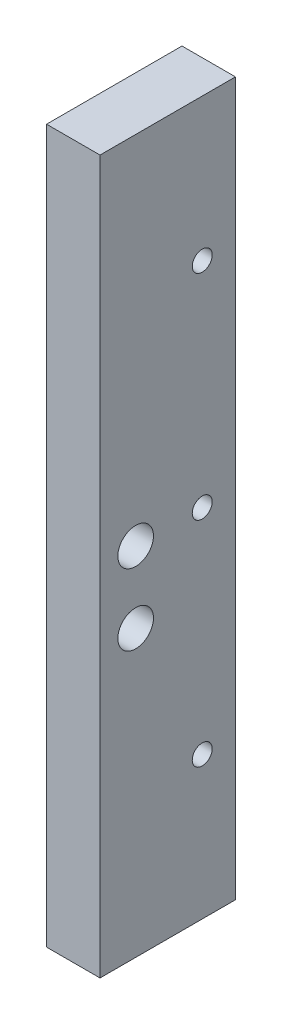
ISO-10303-21;
HEADER;
FILE_DESCRIPTION(('STEP AP214'),'2;1');
FILE_NAME('part.step','',(''),(''),'','','');
FILE_SCHEMA(('AUTOMOTIVE_DESIGN { 1 0 10303 214 1 1 1 1 }'));
ENDSEC;
DATA;
#1=APPLICATION_CONTEXT('core data for automotive mechanical design processes');
#2=APPLICATION_PROTOCOL_DEFINITION('international standard','automotive_design',2000,#1);
#3=PRODUCT_CONTEXT('',#1,'mechanical');
#4=PRODUCT('Part','Part','',(#3));
#5=PRODUCT_RELATED_PRODUCT_CATEGORY('part','',(#4));
#6=PRODUCT_DEFINITION_FORMATION('','',#4);
#7=PRODUCT_DEFINITION_CONTEXT('part definition',#1,'design');
#8=PRODUCT_DEFINITION('design','',#6,#7);
#9=PRODUCT_DEFINITION_SHAPE('','',#8);
#10=(LENGTH_UNIT() NAMED_UNIT(*) SI_UNIT(.MILLI.,.METRE.));
#11=(NAMED_UNIT(*) PLANE_ANGLE_UNIT() SI_UNIT($,.RADIAN.));
#12=(NAMED_UNIT(*) SI_UNIT($,.STERADIAN.) SOLID_ANGLE_UNIT());
#13=UNCERTAINTY_MEASURE_WITH_UNIT(LENGTH_MEASURE(1.E-05),#10,'distance_accuracy_value','');
#14=(GEOMETRIC_REPRESENTATION_CONTEXT(3) GLOBAL_UNCERTAINTY_ASSIGNED_CONTEXT((#13)) GLOBAL_UNIT_ASSIGNED_CONTEXT((#10,
#11,#12)) REPRESENTATION_CONTEXT('',''));
#15=CARTESIAN_POINT('',(0.,0.,0.));
#16=DIRECTION('',(0.,0.,1.));
#17=DIRECTION('',(1.,0.,0.));
#18=AXIS2_PLACEMENT_3D('',#15,#16,#17);
#19=CARTESIAN_POINT('',(0.,0.,24.13));
#20=DIRECTION('',(1.,0.,0.));
#21=DIRECTION('',(0.,0.,-1.));
#22=AXIS2_PLACEMENT_3D('',#19,#20,#21);
#23=PLANE('',#22);
#24=CARTESIAN_POINT('',(0.,50.8,17.78));
#25=DIRECTION('',(1.,0.,0.));
#26=DIRECTION('',(0.,0.,-1.));
#27=AXIS2_PLACEMENT_3D('',#24,#25,#26);
#28=CIRCLE('',#27,3.175);
#29=CARTESIAN_POINT('',(0.,50.8,14.605));
#30=VERTEX_POINT('',#29);
#31=EDGE_CURVE('E132',#30,#30,#28,.T.);
#32=ORIENTED_EDGE('',*,*,#31,.T.);
#33=EDGE_LOOP('',(#32));
#34=FACE_BOUND('',#33,.T.);
#35=CARTESIAN_POINT('',(0.,63.5,17.78));
#36=DIRECTION('',(1.,0.,0.));
#37=DIRECTION('',(0.,0.,-1.));
#38=AXIS2_PLACEMENT_3D('',#35,#36,#37);
#39=CIRCLE('',#38,3.175);
#40=CARTESIAN_POINT('',(0.,63.5,14.605));
#41=VERTEX_POINT('',#40);
#42=EDGE_CURVE('E124',#41,#41,#39,.T.);
#43=ORIENTED_EDGE('',*,*,#42,.T.);
#44=EDGE_LOOP('',(#43));
#45=FACE_BOUND('',#44,.T.);
#46=CARTESIAN_POINT('',(0.,25.4,5.91820000000001));
#47=DIRECTION('',(-1.,0.,0.));
#48=DIRECTION('',(0.,0.,1.));
#49=AXIS2_PLACEMENT_3D('',#46,#47,#48);
#50=CIRCLE('',#49,1.778);
#51=CARTESIAN_POINT('',(0.,25.4,7.69620000000001));
#52=VERTEX_POINT('',#51);
#53=EDGE_CURVE('E121',#52,#52,#50,.T.);
#54=ORIENTED_EDGE('',*,*,#53,.F.);
#55=EDGE_LOOP('',(#54));
#56=FACE_BOUND('',#55,.T.);
#57=CARTESIAN_POINT('',(0.,63.5,5.91820000000001));
#58=DIRECTION('',(-1.,0.,0.));
#59=DIRECTION('',(0.,0.,1.));
#60=AXIS2_PLACEMENT_3D('',#57,#58,#59);
#61=CIRCLE('',#60,1.778);
#62=CARTESIAN_POINT('',(0.,63.5,7.69620000000001));
#63=VERTEX_POINT('',#62);
#64=EDGE_CURVE('E115',#63,#63,#61,.T.);
#65=ORIENTED_EDGE('',*,*,#64,.F.);
#66=EDGE_LOOP('',(#65));
#67=FACE_BOUND('',#66,.T.);
#68=CARTESIAN_POINT('',(0.,101.6,5.9182));
#69=DIRECTION('',(-1.,0.,0.));
#70=DIRECTION('',(0.,0.,1.));
#71=AXIS2_PLACEMENT_3D('',#68,#69,#70);
#72=CIRCLE('',#71,1.778);
#73=CARTESIAN_POINT('',(0.,101.6,7.6962));
#74=VERTEX_POINT('',#73);
#75=EDGE_CURVE('E109',#74,#74,#72,.T.);
#76=ORIENTED_EDGE('',*,*,#75,.F.);
#77=EDGE_LOOP('',(#76));
#78=FACE_BOUND('',#77,.T.);
#79=DIRECTION('',(0.,-1.,0.));
#80=VECTOR('',#79,1.);
#81=CARTESIAN_POINT('',(0.,0.,0.));
#82=LINE('',#81,#80);
#83=CARTESIAN_POINT('',(0.,127.,0.));
#84=VERTEX_POINT('',#83);
#85=CARTESIAN_POINT('',(0.,0.,0.));
#86=VERTEX_POINT('',#85);
#87=EDGE_CURVE('E95',#84,#86,#82,.T.);
#88=ORIENTED_EDGE('',*,*,#87,.T.);
#89=DIRECTION('',(0.,0.,-1.));
#90=VECTOR('',#89,1.);
#91=CARTESIAN_POINT('',(0.,0.,24.13));
#92=LINE('',#91,#90);
#93=CARTESIAN_POINT('',(0.,0.,24.13));
#94=VERTEX_POINT('',#93);
#95=EDGE_CURVE('E11',#94,#86,#92,.T.);
#96=ORIENTED_EDGE('',*,*,#95,.F.);
#97=DIRECTION('',(0.,-1.,0.));
#98=VECTOR('',#97,1.);
#99=CARTESIAN_POINT('',(0.,0.,24.13));
#100=LINE('',#99,#98);
#101=CARTESIAN_POINT('',(0.,127.,24.13));
#102=VERTEX_POINT('',#101);
#103=EDGE_CURVE('E83',#102,#94,#100,.T.);
#104=ORIENTED_EDGE('',*,*,#103,.F.);
#105=DIRECTION('',(0.,0.,-1.));
#106=VECTOR('',#105,1.);
#107=CARTESIAN_POINT('',(0.,127.,24.13));
#108=LINE('',#107,#106);
#109=EDGE_CURVE('E91',#102,#84,#108,.T.);
#110=ORIENTED_EDGE('',*,*,#109,.T.);
#111=EDGE_LOOP('',(#88,#96,#104,#110));
#112=FACE_BOUND('',#111,.T.);
#113=ADVANCED_FACE('F32',(#34,#45,#56,#67,#78,#112),#23,.F.);
#114=CARTESIAN_POINT('',(0.,0.,24.13));
#115=DIRECTION('',(0.,1.,0.));
#116=DIRECTION('',(0.,0.,1.));
#117=AXIS2_PLACEMENT_3D('',#114,#115,#116);
#118=PLANE('',#117);
#119=DIRECTION('',(1.,0.,0.));
#120=VECTOR('',#119,1.);
#121=CARTESIAN_POINT('',(0.,0.,0.));
#122=LINE('',#121,#120);
#123=CARTESIAN_POINT('',(9.525,0.,0.));
#124=VERTEX_POINT('',#123);
#125=EDGE_CURVE('E87',#86,#124,#122,.T.);
#126=ORIENTED_EDGE('',*,*,#125,.T.);
#127=DIRECTION('',(0.,0.,-1.));
#128=VECTOR('',#127,1.);
#129=CARTESIAN_POINT('',(9.525,0.,24.13));
#130=LINE('',#129,#128);
#131=CARTESIAN_POINT('',(9.525,0.,24.13));
#132=VERTEX_POINT('',#131);
#133=EDGE_CURVE('E40',#132,#124,#130,.T.);
#134=ORIENTED_EDGE('',*,*,#133,.F.);
#135=DIRECTION('',(1.,0.,0.));
#136=VECTOR('',#135,1.);
#137=CARTESIAN_POINT('',(0.,0.,24.13));
#138=LINE('',#137,#136);
#139=EDGE_CURVE('E78',#94,#132,#138,.T.);
#140=ORIENTED_EDGE('',*,*,#139,.F.);
#141=ORIENTED_EDGE('',*,*,#95,.T.);
#142=EDGE_LOOP('',(#126,#134,#140,#141));
#143=FACE_BOUND('',#142,.T.);
#144=ADVANCED_FACE('F86',(#143),#118,.F.);
#145=CARTESIAN_POINT('',(9.525,0.,24.13));
#146=DIRECTION('',(-1.,0.,0.));
#147=DIRECTION('',(0.,0.,1.));
#148=AXIS2_PLACEMENT_3D('',#145,#146,#147);
#149=PLANE('',#148);
#150=CARTESIAN_POINT('',(9.525,50.8,17.78));
#151=DIRECTION('',(1.,0.,0.));
#152=DIRECTION('',(0.,1.,0.));
#153=AXIS2_PLACEMENT_3D('',#150,#151,#152);
#154=CIRCLE('',#153,3.175);
#155=CARTESIAN_POINT('',(9.525,53.975,17.78));
#156=VERTEX_POINT('',#155);
#157=EDGE_CURVE('E135',#156,#156,#154,.T.);
#158=ORIENTED_EDGE('',*,*,#157,.F.);
#159=EDGE_LOOP('',(#158));
#160=FACE_BOUND('',#159,.T.);
#161=CARTESIAN_POINT('',(9.525,63.5,17.78));
#162=DIRECTION('',(1.,0.,0.));
#163=DIRECTION('',(0.,1.,0.));
#164=AXIS2_PLACEMENT_3D('',#161,#162,#163);
#165=CIRCLE('',#164,3.175);
#166=CARTESIAN_POINT('',(9.525,66.675,17.78));
#167=VERTEX_POINT('',#166);
#168=EDGE_CURVE('E129',#167,#167,#165,.T.);
#169=ORIENTED_EDGE('',*,*,#168,.F.);
#170=EDGE_LOOP('',(#169));
#171=FACE_BOUND('',#170,.T.);
#172=CARTESIAN_POINT('',(9.525,25.4,5.91820000000001));
#173=DIRECTION('',(-1.,0.,0.));
#174=DIRECTION('',(0.,0.,1.));
#175=AXIS2_PLACEMENT_3D('',#172,#173,#174);
#176=CIRCLE('',#175,1.778);
#177=CARTESIAN_POINT('',(9.525,25.4,7.69620000000001));
#178=VERTEX_POINT('',#177);
#179=EDGE_CURVE('E118',#178,#178,#176,.T.);
#180=ORIENTED_EDGE('',*,*,#179,.T.);
#181=EDGE_LOOP('',(#180));
#182=FACE_BOUND('',#181,.T.);
#183=CARTESIAN_POINT('',(9.525,63.5,5.91820000000001));
#184=DIRECTION('',(-1.,0.,0.));
#185=DIRECTION('',(0.,0.,1.));
#186=AXIS2_PLACEMENT_3D('',#183,#184,#185);
#187=CIRCLE('',#186,1.778);
#188=CARTESIAN_POINT('',(9.525,63.5,7.69620000000001));
#189=VERTEX_POINT('',#188);
#190=EDGE_CURVE('E112',#189,#189,#187,.T.);
#191=ORIENTED_EDGE('',*,*,#190,.T.);
#192=EDGE_LOOP('',(#191));
#193=FACE_BOUND('',#192,.T.);
#194=CARTESIAN_POINT('',(9.525,101.6,5.9182));
#195=DIRECTION('',(-1.,0.,0.));
#196=DIRECTION('',(0.,0.,1.));
#197=AXIS2_PLACEMENT_3D('',#194,#195,#196);
#198=CIRCLE('',#197,1.778);
#199=CARTESIAN_POINT('',(9.525,101.6,7.6962));
#200=VERTEX_POINT('',#199);
#201=EDGE_CURVE('E98',#200,#200,#198,.T.);
#202=ORIENTED_EDGE('',*,*,#201,.T.);
#203=EDGE_LOOP('',(#202));
#204=FACE_BOUND('',#203,.T.);
#205=DIRECTION('',(0.,1.,0.));
#206=VECTOR('',#205,1.);
#207=CARTESIAN_POINT('',(9.525,0.,0.));
#208=LINE('',#207,#206);
#209=CARTESIAN_POINT('',(9.525,127.,0.));
#210=VERTEX_POINT('',#209);
#211=EDGE_CURVE('E65',#124,#210,#208,.T.);
#212=ORIENTED_EDGE('',*,*,#211,.T.);
#213=DIRECTION('',(0.,0.,-1.));
#214=VECTOR('',#213,1.);
#215=CARTESIAN_POINT('',(9.525,127.,24.13));
#216=LINE('',#215,#214);
#217=CARTESIAN_POINT('',(9.525,127.,24.13));
#218=VERTEX_POINT('',#217);
#219=EDGE_CURVE('E88',#218,#210,#216,.T.);
#220=ORIENTED_EDGE('',*,*,#219,.F.);
#221=DIRECTION('',(0.,1.,0.));
#222=VECTOR('',#221,1.);
#223=CARTESIAN_POINT('',(9.525,0.,24.13));
#224=LINE('',#223,#222);
#225=EDGE_CURVE('E81',#132,#218,#224,.T.);
#226=ORIENTED_EDGE('',*,*,#225,.F.);
#227=ORIENTED_EDGE('',*,*,#133,.T.);
#228=EDGE_LOOP('',(#212,#220,#226,#227));
#229=FACE_BOUND('',#228,.T.);
#230=ADVANCED_FACE('F89',(#160,#171,#182,#193,#204,#229),#149,.F.);
#231=CARTESIAN_POINT('',(0.,127.,24.13));
#232=DIRECTION('',(0.,-1.,0.));
#233=DIRECTION('',(0.,0.,-1.));
#234=AXIS2_PLACEMENT_3D('',#231,#232,#233);
#235=PLANE('',#234);
#236=DIRECTION('',(-1.,0.,0.));
#237=VECTOR('',#236,1.);
#238=CARTESIAN_POINT('',(0.,127.,0.));
#239=LINE('',#238,#237);
#240=EDGE_CURVE('E71',#210,#84,#239,.T.);
#241=ORIENTED_EDGE('',*,*,#240,.T.);
#242=ORIENTED_EDGE('',*,*,#109,.F.);
#243=DIRECTION('',(-1.,0.,0.));
#244=VECTOR('',#243,1.);
#245=CARTESIAN_POINT('',(0.,127.,24.13));
#246=LINE('',#245,#244);
#247=EDGE_CURVE('E48',#218,#102,#246,.T.);
#248=ORIENTED_EDGE('',*,*,#247,.F.);
#249=ORIENTED_EDGE('',*,*,#219,.T.);
#250=EDGE_LOOP('',(#241,#242,#248,#249));
#251=FACE_BOUND('',#250,.T.);
#252=ADVANCED_FACE('F103',(#251),#235,.F.);
#253=CARTESIAN_POINT('',(0.,0.,24.13));
#254=DIRECTION('',(0.,0.,-1.));
#255=DIRECTION('',(-1.,0.,0.));
#256=AXIS2_PLACEMENT_3D('',#253,#254,#255);
#257=PLANE('',#256);
#258=ORIENTED_EDGE('',*,*,#103,.T.);
#259=ORIENTED_EDGE('',*,*,#139,.T.);
#260=ORIENTED_EDGE('',*,*,#225,.T.);
#261=ORIENTED_EDGE('',*,*,#247,.T.);
#262=EDGE_LOOP('',(#258,#259,#260,#261));
#263=FACE_BOUND('',#262,.T.);
#264=ADVANCED_FACE('F79',(#263),#257,.F.);
#265=CARTESIAN_POINT('',(0.,0.,0.));
#266=DIRECTION('',(0.,0.,-1.));
#267=DIRECTION('',(-1.,0.,0.));
#268=AXIS2_PLACEMENT_3D('',#265,#266,#267);
#269=PLANE('',#268);
#270=ORIENTED_EDGE('',*,*,#87,.F.);
#271=ORIENTED_EDGE('',*,*,#240,.F.);
#272=ORIENTED_EDGE('',*,*,#211,.F.);
#273=ORIENTED_EDGE('',*,*,#125,.F.);
#274=EDGE_LOOP('',(#270,#271,#272,#273));
#275=FACE_BOUND('',#274,.T.);
#276=ADVANCED_FACE('F106',(#275),#269,.T.);
#277=CARTESIAN_POINT('',(9.525,101.6,5.9182));
#278=DIRECTION('',(-1.,0.,0.));
#279=DIRECTION('',(0.,0.,1.));
#280=AXIS2_PLACEMENT_3D('',#277,#278,#279);
#281=CYLINDRICAL_SURFACE('',#280,1.778);
#282=ORIENTED_EDGE('',*,*,#201,.F.);
#283=EDGE_LOOP('',(#282));
#284=FACE_BOUND('',#283,.T.);
#285=ORIENTED_EDGE('',*,*,#75,.T.);
#286=EDGE_LOOP('',(#285));
#287=FACE_BOUND('',#286,.T.);
#288=ADVANCED_FACE('F153',(#284,#287),#281,.F.);
#289=CARTESIAN_POINT('',(9.525,63.5,5.91820000000001));
#290=DIRECTION('',(-1.,0.,0.));
#291=DIRECTION('',(0.,0.,1.));
#292=AXIS2_PLACEMENT_3D('',#289,#290,#291);
#293=CYLINDRICAL_SURFACE('',#292,1.778);
#294=ORIENTED_EDGE('',*,*,#190,.F.);
#295=EDGE_LOOP('',(#294));
#296=FACE_BOUND('',#295,.T.);
#297=ORIENTED_EDGE('',*,*,#64,.T.);
#298=EDGE_LOOP('',(#297));
#299=FACE_BOUND('',#298,.T.);
#300=ADVANCED_FACE('F156',(#296,#299),#293,.F.);
#301=CARTESIAN_POINT('',(9.525,25.4,5.91820000000001));
#302=DIRECTION('',(-1.,0.,0.));
#303=DIRECTION('',(0.,0.,1.));
#304=AXIS2_PLACEMENT_3D('',#301,#302,#303);
#305=CYLINDRICAL_SURFACE('',#304,1.778);
#306=ORIENTED_EDGE('',*,*,#179,.F.);
#307=EDGE_LOOP('',(#306));
#308=FACE_BOUND('',#307,.T.);
#309=ORIENTED_EDGE('',*,*,#53,.T.);
#310=EDGE_LOOP('',(#309));
#311=FACE_BOUND('',#310,.T.);
#312=ADVANCED_FACE('F174',(#308,#311),#305,.F.);
#313=CARTESIAN_POINT('',(-28.575,63.5,17.78));
#314=DIRECTION('',(1.,0.,0.));
#315=DIRECTION('',(0.,1.,0.));
#316=AXIS2_PLACEMENT_3D('',#313,#314,#315);
#317=CYLINDRICAL_SURFACE('',#316,3.175);
#318=ORIENTED_EDGE('',*,*,#168,.T.);
#319=EDGE_LOOP('',(#318));
#320=FACE_BOUND('',#319,.T.);
#321=ORIENTED_EDGE('',*,*,#42,.F.);
#322=EDGE_LOOP('',(#321));
#323=FACE_BOUND('',#322,.T.);
#324=ADVANCED_FACE('F180',(#320,#323),#317,.F.);
#325=CARTESIAN_POINT('',(-28.575,50.8,17.78));
#326=DIRECTION('',(1.,0.,0.));
#327=DIRECTION('',(0.,1.,0.));
#328=AXIS2_PLACEMENT_3D('',#325,#326,#327);
#329=CYLINDRICAL_SURFACE('',#328,3.175);
#330=ORIENTED_EDGE('',*,*,#157,.T.);
#331=EDGE_LOOP('',(#330));
#332=FACE_BOUND('',#331,.T.);
#333=ORIENTED_EDGE('',*,*,#31,.F.);
#334=EDGE_LOOP('',(#333));
#335=FACE_BOUND('',#334,.T.);
#336=ADVANCED_FACE('F139',(#332,#335),#329,.F.);
#337=CLOSED_SHELL('',(#113,#144,#230,#252,#264,#276,#288,#300,#312,#324,#336));
#338=MANIFOLD_SOLID_BREP('B2',#337);
#339=ADVANCED_BREP_SHAPE_REPRESENTATION('',(#18,#338),#14);
#340=SHAPE_DEFINITION_REPRESENTATION(#9,#339);
ENDSEC;
END-ISO-10303-21;
